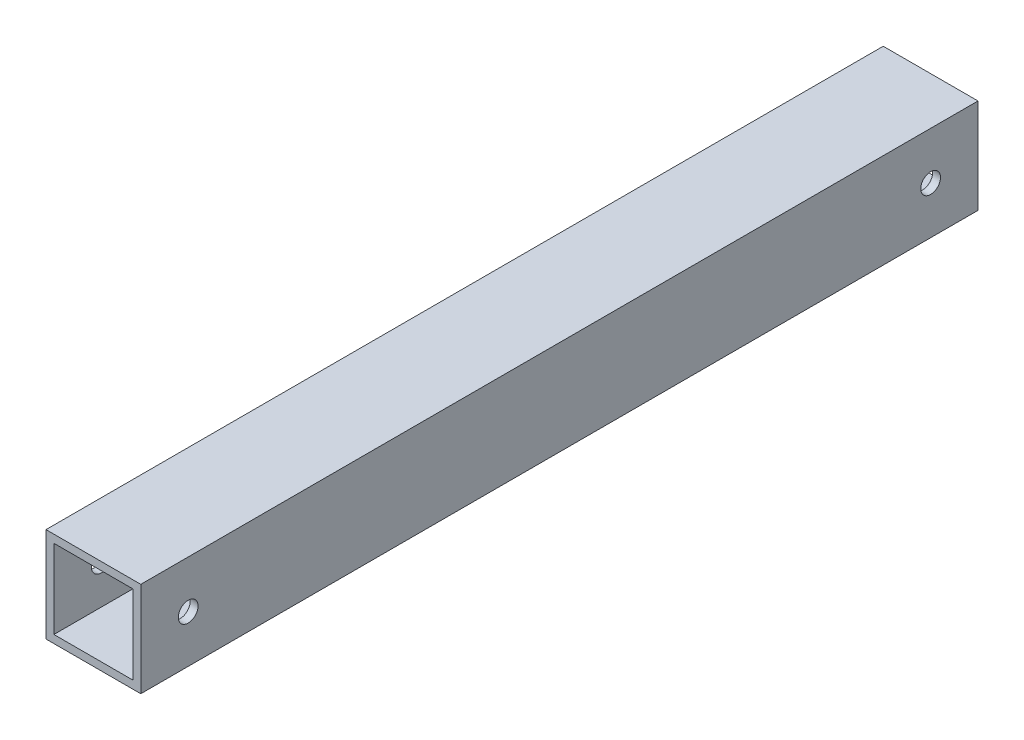
ISO-10303-21;
HEADER;
FILE_DESCRIPTION(('STEP AP214'),'2;1');
FILE_NAME('part.step','',(''),(''),'','','');
FILE_SCHEMA(('AUTOMOTIVE_DESIGN { 1 0 10303 214 1 1 1 1 }'));
ENDSEC;
DATA;
#1=APPLICATION_CONTEXT('core data for automotive mechanical design processes');
#2=APPLICATION_PROTOCOL_DEFINITION('international standard','automotive_design',2000,#1);
#3=PRODUCT_CONTEXT('',#1,'mechanical');
#4=PRODUCT('Part','Part','',(#3));
#5=PRODUCT_RELATED_PRODUCT_CATEGORY('part','',(#4));
#6=PRODUCT_DEFINITION_FORMATION('','',#4);
#7=PRODUCT_DEFINITION_CONTEXT('part definition',#1,'design');
#8=PRODUCT_DEFINITION('design','',#6,#7);
#9=PRODUCT_DEFINITION_SHAPE('','',#8);
#10=(LENGTH_UNIT() NAMED_UNIT(*) SI_UNIT(.MILLI.,.METRE.));
#11=(NAMED_UNIT(*) PLANE_ANGLE_UNIT() SI_UNIT($,.RADIAN.));
#12=(NAMED_UNIT(*) SI_UNIT($,.STERADIAN.) SOLID_ANGLE_UNIT());
#13=UNCERTAINTY_MEASURE_WITH_UNIT(LENGTH_MEASURE(1.E-05),#10,'distance_accuracy_value','');
#14=(GEOMETRIC_REPRESENTATION_CONTEXT(3) GLOBAL_UNCERTAINTY_ASSIGNED_CONTEXT((#13)) GLOBAL_UNIT_ASSIGNED_CONTEXT((#10,
#11,#12)) REPRESENTATION_CONTEXT('',''));
#15=CARTESIAN_POINT('',(0.,0.,0.));
#16=DIRECTION('',(0.,0.,1.));
#17=DIRECTION('',(1.,0.,0.));
#18=AXIS2_PLACEMENT_3D('',#15,#16,#17);
#19=CARTESIAN_POINT('',(38.1,-38.1,336.55));
#20=DIRECTION('',(-1.,0.,0.));
#21=DIRECTION('',(0.,0.,1.));
#22=AXIS2_PLACEMENT_3D('',#19,#20,#21);
#23=PLANE('',#22);
#24=DIRECTION('',(0.,1.,0.));
#25=VECTOR('',#24,1.);
#26=CARTESIAN_POINT('',(38.1,-38.1,-336.55));
#27=LINE('',#26,#25);
#28=CARTESIAN_POINT('',(38.1,-38.1,-336.55));
#29=VERTEX_POINT('',#28);
#30=CARTESIAN_POINT('',(38.1,38.1,-336.55));
#31=VERTEX_POINT('',#30);
#32=EDGE_CURVE('E116',#29,#31,#27,.T.);
#33=ORIENTED_EDGE('',*,*,#32,.T.);
#34=DIRECTION('',(0.,0.,-1.));
#35=VECTOR('',#34,1.);
#36=CARTESIAN_POINT('',(38.1,38.1,336.55));
#37=LINE('',#36,#35);
#38=CARTESIAN_POINT('',(38.1,38.1,336.55));
#39=VERTEX_POINT('',#38);
#40=EDGE_CURVE('E11',#39,#31,#37,.T.);
#41=ORIENTED_EDGE('',*,*,#40,.F.);
#42=DIRECTION('',(0.,1.,0.));
#43=VECTOR('',#42,1.);
#44=CARTESIAN_POINT('',(38.1,-38.1,336.55));
#45=LINE('',#44,#43);
#46=CARTESIAN_POINT('',(38.1,-38.1,336.55));
#47=VERTEX_POINT('',#46);
#48=EDGE_CURVE('E139',#47,#39,#45,.T.);
#49=ORIENTED_EDGE('',*,*,#48,.F.);
#50=DIRECTION('',(0.,0.,-1.));
#51=VECTOR('',#50,1.);
#52=CARTESIAN_POINT('',(38.1,-38.1,336.55));
#53=LINE('',#52,#51);
#54=EDGE_CURVE('E149',#47,#29,#53,.T.);
#55=ORIENTED_EDGE('',*,*,#54,.T.);
#56=EDGE_LOOP('',(#33,#41,#49,#55));
#57=FACE_BOUND('',#56,.T.);
#58=CARTESIAN_POINT('',(38.1,0.,-298.45));
#59=DIRECTION('',(1.,0.,0.));
#60=DIRECTION('',(0.,0.,-1.));
#61=AXIS2_PLACEMENT_3D('',#58,#59,#60);
#62=CIRCLE('',#61,7.93749999999998);
#63=CARTESIAN_POINT('',(38.1,0.,-306.3875));
#64=VERTEX_POINT('',#63);
#65=EDGE_CURVE('E170',#64,#64,#62,.T.);
#66=ORIENTED_EDGE('',*,*,#65,.F.);
#67=EDGE_LOOP('',(#66));
#68=FACE_BOUND('',#67,.T.);
#69=CARTESIAN_POINT('',(38.1,0.,298.45));
#70=DIRECTION('',(-1.,0.,0.));
#71=DIRECTION('',(0.,0.,1.));
#72=AXIS2_PLACEMENT_3D('',#69,#70,#71);
#73=CIRCLE('',#72,7.93749999999998);
#74=CARTESIAN_POINT('',(38.1,0.,306.3875));
#75=VERTEX_POINT('',#74);
#76=EDGE_CURVE('E180',#75,#75,#73,.T.);
#77=ORIENTED_EDGE('',*,*,#76,.T.);
#78=EDGE_LOOP('',(#77));
#79=FACE_BOUND('',#78,.T.);
#80=ADVANCED_FACE('F33',(#57,#68,#79),#23,.F.);
#81=CARTESIAN_POINT('',(-38.1,-38.1,336.55));
#82=DIRECTION('',(1.,0.,0.));
#83=DIRECTION('',(0.,0.,-1.));
#84=AXIS2_PLACEMENT_3D('',#81,#82,#83);
#85=PLANE('',#84);
#86=DIRECTION('',(0.,-1.,0.));
#87=VECTOR('',#86,1.);
#88=CARTESIAN_POINT('',(-38.1,-38.1,-336.55));
#89=LINE('',#88,#87);
#90=CARTESIAN_POINT('',(-38.1,38.1,-336.55));
#91=VERTEX_POINT('',#90);
#92=CARTESIAN_POINT('',(-38.1,-38.1,-336.55));
#93=VERTEX_POINT('',#92);
#94=EDGE_CURVE('E154',#91,#93,#89,.T.);
#95=ORIENTED_EDGE('',*,*,#94,.T.);
#96=DIRECTION('',(0.,0.,-1.));
#97=VECTOR('',#96,1.);
#98=CARTESIAN_POINT('',(-38.1,-38.1,336.55));
#99=LINE('',#98,#97);
#100=CARTESIAN_POINT('',(-38.1,-38.1,336.55));
#101=VERTEX_POINT('',#100);
#102=EDGE_CURVE('E159',#101,#93,#99,.T.);
#103=ORIENTED_EDGE('',*,*,#102,.F.);
#104=DIRECTION('',(0.,-1.,0.));
#105=VECTOR('',#104,1.);
#106=CARTESIAN_POINT('',(-38.1,-38.1,336.55));
#107=LINE('',#106,#105);
#108=CARTESIAN_POINT('',(-38.1,38.1,336.55));
#109=VERTEX_POINT('',#108);
#110=EDGE_CURVE('E145',#109,#101,#107,.T.);
#111=ORIENTED_EDGE('',*,*,#110,.F.);
#112=DIRECTION('',(0.,0.,-1.));
#113=VECTOR('',#112,1.);
#114=CARTESIAN_POINT('',(-38.1,38.1,336.55));
#115=LINE('',#114,#113);
#116=EDGE_CURVE('E41',#109,#91,#115,.T.);
#117=ORIENTED_EDGE('',*,*,#116,.T.);
#118=EDGE_LOOP('',(#95,#103,#111,#117));
#119=FACE_BOUND('',#118,.T.);
#120=CARTESIAN_POINT('',(-38.1,0.,-298.45));
#121=DIRECTION('',(1.,0.,0.));
#122=DIRECTION('',(0.,0.,-1.));
#123=AXIS2_PLACEMENT_3D('',#120,#121,#122);
#124=CIRCLE('',#123,7.93749999999998);
#125=CARTESIAN_POINT('',(-38.1,0.,-306.3875));
#126=VERTEX_POINT('',#125);
#127=EDGE_CURVE('E165',#126,#126,#124,.T.);
#128=ORIENTED_EDGE('',*,*,#127,.T.);
#129=EDGE_LOOP('',(#128));
#130=FACE_BOUND('',#129,.T.);
#131=CARTESIAN_POINT('',(-38.1,0.,298.45));
#132=DIRECTION('',(-1.,0.,0.));
#133=DIRECTION('',(0.,0.,1.));
#134=AXIS2_PLACEMENT_3D('',#131,#132,#133);
#135=CIRCLE('',#134,7.93749999999998);
#136=CARTESIAN_POINT('',(-38.1,0.,306.3875));
#137=VERTEX_POINT('',#136);
#138=EDGE_CURVE('E183',#137,#137,#135,.T.);
#139=ORIENTED_EDGE('',*,*,#138,.F.);
#140=EDGE_LOOP('',(#139));
#141=FACE_BOUND('',#140,.T.);
#142=ADVANCED_FACE('F206',(#119,#130,#141),#85,.F.);
#143=CARTESIAN_POINT('',(31.75,-31.75,336.55));
#144=DIRECTION('',(-1.,0.,0.));
#145=DIRECTION('',(0.,0.,1.));
#146=AXIS2_PLACEMENT_3D('',#143,#144,#145);
#147=PLANE('',#146);
#148=DIRECTION('',(0.,1.,0.));
#149=VECTOR('',#148,1.);
#150=CARTESIAN_POINT('',(31.75,-31.75,-336.55));
#151=LINE('',#150,#149);
#152=CARTESIAN_POINT('',(31.75,-31.75,-336.55));
#153=VERTEX_POINT('',#152);
#154=CARTESIAN_POINT('',(31.75,31.75,-336.55));
#155=VERTEX_POINT('',#154);
#156=EDGE_CURVE('E57',#153,#155,#151,.T.);
#157=ORIENTED_EDGE('',*,*,#156,.F.);
#158=DIRECTION('',(0.,0.,-1.));
#159=VECTOR('',#158,1.);
#160=CARTESIAN_POINT('',(31.75,-31.75,336.55));
#161=LINE('',#160,#159);
#162=CARTESIAN_POINT('',(31.75,-31.75,336.55));
#163=VERTEX_POINT('',#162);
#164=EDGE_CURVE('E104',#163,#153,#161,.T.);
#165=ORIENTED_EDGE('',*,*,#164,.F.);
#166=DIRECTION('',(0.,1.,0.));
#167=VECTOR('',#166,1.);
#168=CARTESIAN_POINT('',(31.75,-31.75,336.55));
#169=LINE('',#168,#167);
#170=CARTESIAN_POINT('',(31.75,31.75,336.55));
#171=VERTEX_POINT('',#170);
#172=EDGE_CURVE('E99',#163,#171,#169,.T.);
#173=ORIENTED_EDGE('',*,*,#172,.T.);
#174=DIRECTION('',(0.,0.,-1.));
#175=VECTOR('',#174,1.);
#176=CARTESIAN_POINT('',(31.75,31.75,336.55));
#177=LINE('',#176,#175);
#178=EDGE_CURVE('E103',#171,#155,#177,.T.);
#179=ORIENTED_EDGE('',*,*,#178,.T.);
#180=EDGE_LOOP('',(#157,#165,#173,#179));
#181=FACE_BOUND('',#180,.T.);
#182=CARTESIAN_POINT('',(31.75,0.,-298.45));
#183=DIRECTION('',(-1.,0.,0.));
#184=DIRECTION('',(0.,0.,1.));
#185=AXIS2_PLACEMENT_3D('',#182,#183,#184);
#186=CIRCLE('',#185,7.93749999999998);
#187=CARTESIAN_POINT('',(31.75,0.,-290.5125));
#188=VERTEX_POINT('',#187);
#189=EDGE_CURVE('E129',#188,#188,#186,.T.);
#190=ORIENTED_EDGE('',*,*,#189,.F.);
#191=EDGE_LOOP('',(#190));
#192=FACE_BOUND('',#191,.T.);
#193=CARTESIAN_POINT('',(31.75,0.,298.45));
#194=DIRECTION('',(-1.,0.,0.));
#195=DIRECTION('',(0.,0.,1.));
#196=AXIS2_PLACEMENT_3D('',#193,#194,#195);
#197=CIRCLE('',#196,7.93749999999998);
#198=CARTESIAN_POINT('',(31.75,0.,306.3875));
#199=VERTEX_POINT('',#198);
#200=EDGE_CURVE('E175',#199,#199,#197,.F.);
#201=ORIENTED_EDGE('',*,*,#200,.T.);
#202=EDGE_LOOP('',(#201));
#203=FACE_BOUND('',#202,.T.);
#204=ADVANCED_FACE('F101',(#181,#192,#203),#147,.T.);
#205=CARTESIAN_POINT('',(-31.75,-31.75,336.55));
#206=DIRECTION('',(1.,0.,0.));
#207=DIRECTION('',(0.,0.,-1.));
#208=AXIS2_PLACEMENT_3D('',#205,#206,#207);
#209=PLANE('',#208);
#210=DIRECTION('',(0.,-1.,0.));
#211=VECTOR('',#210,1.);
#212=CARTESIAN_POINT('',(-31.75,-31.75,-336.55));
#213=LINE('',#212,#211);
#214=CARTESIAN_POINT('',(-31.75,31.75,-336.55));
#215=VERTEX_POINT('',#214);
#216=CARTESIAN_POINT('',(-31.75,-31.75,-336.55));
#217=VERTEX_POINT('',#216);
#218=EDGE_CURVE('E131',#215,#217,#213,.T.);
#219=ORIENTED_EDGE('',*,*,#218,.F.);
#220=DIRECTION('',(0.,0.,-1.));
#221=VECTOR('',#220,1.);
#222=CARTESIAN_POINT('',(-31.75,31.75,336.55));
#223=LINE('',#222,#221);
#224=CARTESIAN_POINT('',(-31.75,31.75,336.55));
#225=VERTEX_POINT('',#224);
#226=EDGE_CURVE('E117',#225,#215,#223,.T.);
#227=ORIENTED_EDGE('',*,*,#226,.F.);
#228=DIRECTION('',(0.,-1.,0.));
#229=VECTOR('',#228,1.);
#230=CARTESIAN_POINT('',(-31.75,-31.75,336.55));
#231=LINE('',#230,#229);
#232=CARTESIAN_POINT('',(-31.75,-31.75,336.55));
#233=VERTEX_POINT('',#232);
#234=EDGE_CURVE('E121',#225,#233,#231,.T.);
#235=ORIENTED_EDGE('',*,*,#234,.T.);
#236=DIRECTION('',(0.,0.,-1.));
#237=VECTOR('',#236,1.);
#238=CARTESIAN_POINT('',(-31.75,-31.75,336.55));
#239=LINE('',#238,#237);
#240=EDGE_CURVE('E49',#233,#217,#239,.T.);
#241=ORIENTED_EDGE('',*,*,#240,.T.);
#242=EDGE_LOOP('',(#219,#227,#235,#241));
#243=FACE_BOUND('',#242,.T.);
#244=CARTESIAN_POINT('',(-31.75,0.,-298.45));
#245=DIRECTION('',(1.,0.,0.));
#246=DIRECTION('',(0.,0.,-1.));
#247=AXIS2_PLACEMENT_3D('',#244,#245,#246);
#248=CIRCLE('',#247,7.93749999999998);
#249=CARTESIAN_POINT('',(-31.75,0.,-306.3875));
#250=VERTEX_POINT('',#249);
#251=EDGE_CURVE('E163',#250,#250,#248,.T.);
#252=ORIENTED_EDGE('',*,*,#251,.F.);
#253=EDGE_LOOP('',(#252));
#254=FACE_BOUND('',#253,.T.);
#255=CARTESIAN_POINT('',(-31.75,0.,298.45));
#256=DIRECTION('',(1.,0.,0.));
#257=DIRECTION('',(0.,0.,-1.));
#258=AXIS2_PLACEMENT_3D('',#255,#256,#257);
#259=CIRCLE('',#258,7.93749999999998);
#260=CARTESIAN_POINT('',(-31.75,0.,290.5125));
#261=VERTEX_POINT('',#260);
#262=EDGE_CURVE('E36',#261,#261,#259,.F.);
#263=ORIENTED_EDGE('',*,*,#262,.T.);
#264=EDGE_LOOP('',(#263));
#265=FACE_BOUND('',#264,.T.);
#266=ADVANCED_FACE('F190',(#243,#254,#265),#209,.T.);
#267=CARTESIAN_POINT('',(38.1,38.1,336.55));
#268=DIRECTION('',(0.,0.,-1.));
#269=DIRECTION('',(-1.,0.,0.));
#270=AXIS2_PLACEMENT_3D('',#267,#268,#269);
#271=PLANE('',#270);
#272=ORIENTED_EDGE('',*,*,#48,.T.);
#273=DIRECTION('',(-1.,0.,0.));
#274=VECTOR('',#273,1.);
#275=CARTESIAN_POINT('',(-38.1,38.1,336.55));
#276=LINE('',#275,#274);
#277=EDGE_CURVE('E142',#39,#109,#276,.T.);
#278=ORIENTED_EDGE('',*,*,#277,.T.);
#279=ORIENTED_EDGE('',*,*,#110,.T.);
#280=DIRECTION('',(1.,0.,0.));
#281=VECTOR('',#280,1.);
#282=CARTESIAN_POINT('',(-38.1,-38.1,336.55));
#283=LINE('',#282,#281);
#284=EDGE_CURVE('E147',#101,#47,#283,.T.);
#285=ORIENTED_EDGE('',*,*,#284,.T.);
#286=EDGE_LOOP('',(#272,#278,#279,#285));
#287=FACE_BOUND('',#286,.T.);
#288=ORIENTED_EDGE('',*,*,#172,.F.);
#289=DIRECTION('',(1.,0.,0.));
#290=VECTOR('',#289,1.);
#291=CARTESIAN_POINT('',(-31.75,-31.75,336.55));
#292=LINE('',#291,#290);
#293=EDGE_CURVE('E123',#233,#163,#292,.T.);
#294=ORIENTED_EDGE('',*,*,#293,.F.);
#295=ORIENTED_EDGE('',*,*,#234,.F.);
#296=DIRECTION('',(-1.,0.,0.));
#297=VECTOR('',#296,1.);
#298=CARTESIAN_POINT('',(-31.75,31.75,336.55));
#299=LINE('',#298,#297);
#300=EDGE_CURVE('E108',#171,#225,#299,.T.);
#301=ORIENTED_EDGE('',*,*,#300,.F.);
#302=EDGE_LOOP('',(#288,#294,#295,#301));
#303=FACE_BOUND('',#302,.T.);
#304=ADVANCED_FACE('F120',(#287,#303),#271,.F.);
#305=CARTESIAN_POINT('',(38.1,38.1,-336.55));
#306=DIRECTION('',(0.,0.,-1.));
#307=DIRECTION('',(-1.,0.,0.));
#308=AXIS2_PLACEMENT_3D('',#305,#306,#307);
#309=PLANE('',#308);
#310=ORIENTED_EDGE('',*,*,#32,.F.);
#311=DIRECTION('',(1.,0.,0.));
#312=VECTOR('',#311,1.);
#313=CARTESIAN_POINT('',(-38.1,-38.1,-336.55));
#314=LINE('',#313,#312);
#315=EDGE_CURVE('E143',#93,#29,#314,.T.);
#316=ORIENTED_EDGE('',*,*,#315,.F.);
#317=ORIENTED_EDGE('',*,*,#94,.F.);
#318=DIRECTION('',(-1.,0.,0.));
#319=VECTOR('',#318,1.);
#320=CARTESIAN_POINT('',(-38.1,38.1,-336.55));
#321=LINE('',#320,#319);
#322=EDGE_CURVE('E152',#31,#91,#321,.T.);
#323=ORIENTED_EDGE('',*,*,#322,.F.);
#324=EDGE_LOOP('',(#310,#316,#317,#323));
#325=FACE_BOUND('',#324,.T.);
#326=DIRECTION('',(1.,0.,0.));
#327=VECTOR('',#326,1.);
#328=CARTESIAN_POINT('',(-31.75,-31.75,-336.55));
#329=LINE('',#328,#327);
#330=EDGE_CURVE('E109',#217,#153,#329,.T.);
#331=ORIENTED_EDGE('',*,*,#330,.T.);
#332=ORIENTED_EDGE('',*,*,#156,.T.);
#333=DIRECTION('',(-1.,0.,0.));
#334=VECTOR('',#333,1.);
#335=CARTESIAN_POINT('',(-31.75,31.75,-336.55));
#336=LINE('',#335,#334);
#337=EDGE_CURVE('E115',#155,#215,#336,.T.);
#338=ORIENTED_EDGE('',*,*,#337,.T.);
#339=ORIENTED_EDGE('',*,*,#218,.T.);
#340=EDGE_LOOP('',(#331,#332,#338,#339));
#341=FACE_BOUND('',#340,.T.);
#342=ADVANCED_FACE('F225',(#325,#341),#309,.T.);
#343=CARTESIAN_POINT('',(-38.1,38.1,336.55));
#344=DIRECTION('',(0.,-1.,0.));
#345=DIRECTION('',(0.,0.,-1.));
#346=AXIS2_PLACEMENT_3D('',#343,#344,#345);
#347=PLANE('',#346);
#348=ORIENTED_EDGE('',*,*,#322,.T.);
#349=ORIENTED_EDGE('',*,*,#116,.F.);
#350=ORIENTED_EDGE('',*,*,#277,.F.);
#351=ORIENTED_EDGE('',*,*,#40,.T.);
#352=EDGE_LOOP('',(#348,#349,#350,#351));
#353=FACE_BOUND('',#352,.T.);
#354=ADVANCED_FACE('F230',(#353),#347,.F.);
#355=CARTESIAN_POINT('',(-38.1,-38.1,336.55));
#356=DIRECTION('',(0.,1.,0.));
#357=DIRECTION('',(0.,0.,1.));
#358=AXIS2_PLACEMENT_3D('',#355,#356,#357);
#359=PLANE('',#358);
#360=ORIENTED_EDGE('',*,*,#315,.T.);
#361=ORIENTED_EDGE('',*,*,#54,.F.);
#362=ORIENTED_EDGE('',*,*,#284,.F.);
#363=ORIENTED_EDGE('',*,*,#102,.T.);
#364=EDGE_LOOP('',(#360,#361,#362,#363));
#365=FACE_BOUND('',#364,.T.);
#366=ADVANCED_FACE('F236',(#365),#359,.F.);
#367=CARTESIAN_POINT('',(-31.75,31.75,336.55));
#368=DIRECTION('',(0.,-1.,0.));
#369=DIRECTION('',(0.,0.,-1.));
#370=AXIS2_PLACEMENT_3D('',#367,#368,#369);
#371=PLANE('',#370);
#372=ORIENTED_EDGE('',*,*,#337,.F.);
#373=ORIENTED_EDGE('',*,*,#178,.F.);
#374=ORIENTED_EDGE('',*,*,#300,.T.);
#375=ORIENTED_EDGE('',*,*,#226,.T.);
#376=EDGE_LOOP('',(#372,#373,#374,#375));
#377=FACE_BOUND('',#376,.T.);
#378=ADVANCED_FACE('F112',(#377),#371,.T.);
#379=CARTESIAN_POINT('',(-31.75,-31.75,336.55));
#380=DIRECTION('',(0.,1.,0.));
#381=DIRECTION('',(0.,0.,1.));
#382=AXIS2_PLACEMENT_3D('',#379,#380,#381);
#383=PLANE('',#382);
#384=ORIENTED_EDGE('',*,*,#330,.F.);
#385=ORIENTED_EDGE('',*,*,#240,.F.);
#386=ORIENTED_EDGE('',*,*,#293,.T.);
#387=ORIENTED_EDGE('',*,*,#164,.T.);
#388=EDGE_LOOP('',(#384,#385,#386,#387));
#389=FACE_BOUND('',#388,.T.);
#390=ADVANCED_FACE('F244',(#389),#383,.T.);
#391=CARTESIAN_POINT('',(-38.1,0.,-298.45));
#392=DIRECTION('',(1.,0.,0.));
#393=DIRECTION('',(0.,0.,-1.));
#394=AXIS2_PLACEMENT_3D('',#391,#392,#393);
#395=CYLINDRICAL_SURFACE('',#394,7.93749999999998);
#396=ORIENTED_EDGE('',*,*,#251,.T.);
#397=EDGE_LOOP('',(#396));
#398=FACE_BOUND('',#397,.T.);
#399=ORIENTED_EDGE('',*,*,#127,.F.);
#400=EDGE_LOOP('',(#399));
#401=FACE_BOUND('',#400,.T.);
#402=ADVANCED_FACE('F202',(#398,#401),#395,.F.);
#403=ORIENTED_EDGE('',*,*,#189,.T.);
#404=EDGE_LOOP('',(#403));
#405=FACE_BOUND('',#404,.T.);
#406=ORIENTED_EDGE('',*,*,#65,.T.);
#407=EDGE_LOOP('',(#406));
#408=FACE_BOUND('',#407,.T.);
#409=ADVANCED_FACE('F195',(#405,#408),#395,.F.);
#410=CARTESIAN_POINT('',(-38.1,0.,298.45));
#411=DIRECTION('',(1.,0.,0.));
#412=DIRECTION('',(0.,0.,-1.));
#413=AXIS2_PLACEMENT_3D('',#410,#411,#412);
#414=CYLINDRICAL_SURFACE('',#413,7.93749999999998);
#415=ORIENTED_EDGE('',*,*,#262,.F.);
#416=EDGE_LOOP('',(#415));
#417=FACE_BOUND('',#416,.T.);
#418=ORIENTED_EDGE('',*,*,#138,.T.);
#419=EDGE_LOOP('',(#418));
#420=FACE_BOUND('',#419,.T.);
#421=ADVANCED_FACE('F192',(#417,#420),#414,.F.);
#422=ORIENTED_EDGE('',*,*,#200,.F.);
#423=EDGE_LOOP('',(#422));
#424=FACE_BOUND('',#423,.T.);
#425=ORIENTED_EDGE('',*,*,#76,.F.);
#426=EDGE_LOOP('',(#425));
#427=FACE_BOUND('',#426,.T.);
#428=ADVANCED_FACE('F194',(#424,#427),#414,.F.);
#429=CLOSED_SHELL('',(#80,#142,#204,#266,#304,#342,#354,#366,#378,#390,#402,#409,#421,#428));
#430=MANIFOLD_SOLID_BREP('B2',#429);
#431=ADVANCED_BREP_SHAPE_REPRESENTATION('',(#18,#430),#14);
#432=SHAPE_DEFINITION_REPRESENTATION(#9,#431);
ENDSEC;
END-ISO-10303-21;
